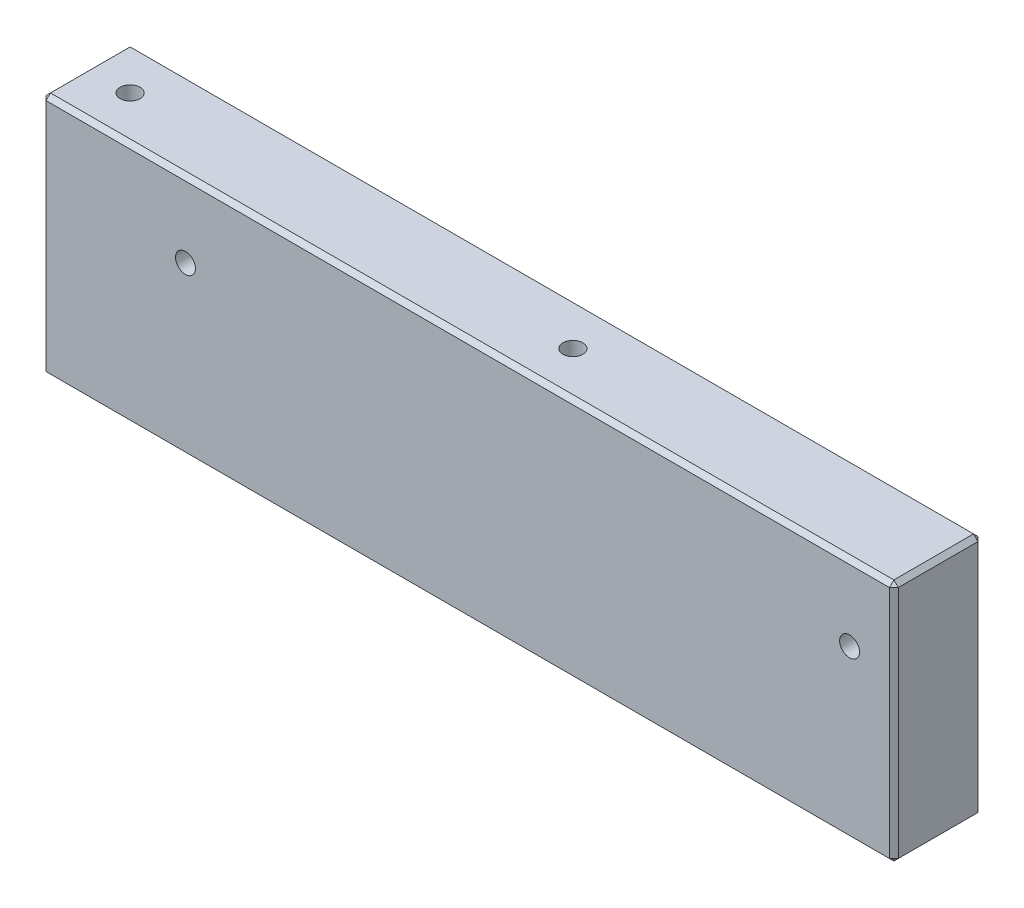
ISO-10303-21;
HEADER;
FILE_DESCRIPTION(('STEP AP214'),'2;1');
FILE_NAME('part.step','',(''),(''),'','','');
FILE_SCHEMA(('AUTOMOTIVE_DESIGN { 1 0 10303 214 1 1 1 1 }'));
ENDSEC;
DATA;
#1=APPLICATION_CONTEXT('core data for automotive mechanical design processes');
#2=APPLICATION_PROTOCOL_DEFINITION('international standard','automotive_design',2000,#1);
#3=PRODUCT_CONTEXT('',#1,'mechanical');
#4=PRODUCT('Part','Part','',(#3));
#5=PRODUCT_RELATED_PRODUCT_CATEGORY('part','',(#4));
#6=PRODUCT_DEFINITION_FORMATION('','',#4);
#7=PRODUCT_DEFINITION_CONTEXT('part definition',#1,'design');
#8=PRODUCT_DEFINITION('design','',#6,#7);
#9=PRODUCT_DEFINITION_SHAPE('','',#8);
#10=(LENGTH_UNIT() NAMED_UNIT(*) SI_UNIT(.MILLI.,.METRE.));
#11=(NAMED_UNIT(*) PLANE_ANGLE_UNIT() SI_UNIT($,.RADIAN.));
#12=(NAMED_UNIT(*) SI_UNIT($,.STERADIAN.) SOLID_ANGLE_UNIT());
#13=UNCERTAINTY_MEASURE_WITH_UNIT(LENGTH_MEASURE(1.E-05),#10,'distance_accuracy_value','');
#14=(GEOMETRIC_REPRESENTATION_CONTEXT(3) GLOBAL_UNCERTAINTY_ASSIGNED_CONTEXT((#13)) GLOBAL_UNIT_ASSIGNED_CONTEXT((#10,
#11,#12)) REPRESENTATION_CONTEXT('',''));
#15=CARTESIAN_POINT('',(0.,0.,0.));
#16=DIRECTION('',(0.,0.,1.));
#17=DIRECTION('',(1.,0.,0.));
#18=AXIS2_PLACEMENT_3D('',#15,#16,#17);
#19=CARTESIAN_POINT('',(0.,0.,20.));
#20=DIRECTION('',(-1.,0.,0.));
#21=DIRECTION('',(0.,-1.,0.));
#22=AXIS2_PLACEMENT_3D('',#19,#20,#21);
#23=PLANE('',#22);
#24=DIRECTION('',(0.,1.,0.));
#25=VECTOR('',#24,1.);
#26=CARTESIAN_POINT('',(0.,55.,19.));
#27=LINE('',#26,#25);
#28=CARTESIAN_POINT('',(0.,1.,19.));
#29=VERTEX_POINT('',#28);
#30=CARTESIAN_POINT('',(0.,54.,19.));
#31=VERTEX_POINT('',#30);
#32=EDGE_CURVE('E195',#29,#31,#27,.T.);
#33=ORIENTED_EDGE('',*,*,#32,.T.);
#34=DIRECTION('',(0.,0.,-1.));
#35=VECTOR('',#34,1.);
#36=CARTESIAN_POINT('',(0.,54.,20.));
#37=LINE('',#36,#35);
#38=CARTESIAN_POINT('',(0.,54.,1.));
#39=VERTEX_POINT('',#38);
#40=EDGE_CURVE('E199',#31,#39,#37,.T.);
#41=ORIENTED_EDGE('',*,*,#40,.T.);
#42=DIRECTION('',(0.,-1.,0.));
#43=VECTOR('',#42,1.);
#44=CARTESIAN_POINT('',(0.,0.,1.));
#45=LINE('',#44,#43);
#46=CARTESIAN_POINT('',(0.,1.,1.));
#47=VERTEX_POINT('',#46);
#48=EDGE_CURVE('E197',#39,#47,#45,.T.);
#49=ORIENTED_EDGE('',*,*,#48,.T.);
#50=DIRECTION('',(0.,0.,1.));
#51=VECTOR('',#50,1.);
#52=CARTESIAN_POINT('',(0.,1.,20.));
#53=LINE('',#52,#51);
#54=EDGE_CURVE('E193',#47,#29,#53,.T.);
#55=ORIENTED_EDGE('',*,*,#54,.T.);
#56=EDGE_LOOP('',(#33,#41,#49,#55));
#57=FACE_BOUND('',#56,.T.);
#58=ADVANCED_FACE('F39',(#57),#23,.T.);
#59=CARTESIAN_POINT('',(192.5,0.,20.));
#60=DIRECTION('',(0.,-1.,0.));
#61=DIRECTION('',(1.,0.,0.));
#62=AXIS2_PLACEMENT_3D('',#59,#60,#61);
#63=PLANE('',#62);
#64=DIRECTION('',(0.,0.,-1.));
#65=VECTOR('',#64,1.);
#66=CARTESIAN_POINT('',(1.,0.,20.));
#67=LINE('',#66,#65);
#68=CARTESIAN_POINT('',(1.,0.,19.));
#69=VERTEX_POINT('',#68);
#70=CARTESIAN_POINT('',(1.,0.,1.));
#71=VERTEX_POINT('',#70);
#72=EDGE_CURVE('E64',#69,#71,#67,.T.);
#73=ORIENTED_EDGE('',*,*,#72,.T.);
#74=DIRECTION('',(1.,0.,0.));
#75=VECTOR('',#74,1.);
#76=CARTESIAN_POINT('',(192.5,0.,1.));
#77=LINE('',#76,#75);
#78=CARTESIAN_POINT('',(191.5,0.,1.));
#79=VERTEX_POINT('',#78);
#80=EDGE_CURVE('E11',#71,#79,#77,.T.);
#81=ORIENTED_EDGE('',*,*,#80,.T.);
#82=DIRECTION('',(0.,0.,1.));
#83=VECTOR('',#82,1.);
#84=CARTESIAN_POINT('',(191.5,0.,20.));
#85=LINE('',#84,#83);
#86=CARTESIAN_POINT('',(191.5,0.,19.));
#87=VERTEX_POINT('',#86);
#88=EDGE_CURVE('E49',#79,#87,#85,.T.);
#89=ORIENTED_EDGE('',*,*,#88,.T.);
#90=DIRECTION('',(-1.,0.,0.));
#91=VECTOR('',#90,1.);
#92=CARTESIAN_POINT('',(0.,0.,19.));
#93=LINE('',#92,#91);
#94=EDGE_CURVE('E211',#87,#69,#93,.T.);
#95=ORIENTED_EDGE('',*,*,#94,.T.);
#96=EDGE_LOOP('',(#73,#81,#89,#95));
#97=FACE_BOUND('',#96,.T.);
#98=CARTESIAN_POINT('',(110.,0.,9.99999999999974));
#99=DIRECTION('',(0.,-1.,0.));
#100=DIRECTION('',(0.,0.,-1.));
#101=AXIS2_PLACEMENT_3D('',#98,#99,#100);
#102=CIRCLE('',#101,4.49999999999999);
#103=CARTESIAN_POINT('',(110.,0.,5.49999999999975));
#104=VERTEX_POINT('',#103);
#105=EDGE_CURVE('E298',#104,#104,#102,.T.);
#106=ORIENTED_EDGE('',*,*,#105,.F.);
#107=EDGE_LOOP('',(#106));
#108=FACE_BOUND('',#107,.T.);
#109=CARTESIAN_POINT('',(10.,0.,9.99999999999997));
#110=DIRECTION('',(0.,-1.,0.));
#111=DIRECTION('',(0.,0.,-1.));
#112=AXIS2_PLACEMENT_3D('',#109,#110,#111);
#113=CIRCLE('',#112,4.49999999999999);
#114=CARTESIAN_POINT('',(10.,0.,5.49999999999998));
#115=VERTEX_POINT('',#114);
#116=EDGE_CURVE('E310',#115,#115,#113,.T.);
#117=ORIENTED_EDGE('',*,*,#116,.F.);
#118=EDGE_LOOP('',(#117));
#119=FACE_BOUND('',#118,.T.);
#120=ADVANCED_FACE('F333',(#97,#108,#119),#63,.T.);
#121=CARTESIAN_POINT('',(192.5,55.,20.));
#122=DIRECTION('',(1.,0.,0.));
#123=DIRECTION('',(0.,0.,-1.));
#124=AXIS2_PLACEMENT_3D('',#121,#122,#123);
#125=PLANE('',#124);
#126=DIRECTION('',(0.,0.,-1.));
#127=VECTOR('',#126,1.);
#128=CARTESIAN_POINT('',(192.5,1.,20.));
#129=LINE('',#128,#127);
#130=CARTESIAN_POINT('',(192.5,1.,19.));
#131=VERTEX_POINT('',#130);
#132=CARTESIAN_POINT('',(192.5,1.,1.));
#133=VERTEX_POINT('',#132);
#134=EDGE_CURVE('E186',#131,#133,#129,.T.);
#135=ORIENTED_EDGE('',*,*,#134,.T.);
#136=DIRECTION('',(0.,1.,0.));
#137=VECTOR('',#136,1.);
#138=CARTESIAN_POINT('',(192.5,55.,1.));
#139=LINE('',#138,#137);
#140=CARTESIAN_POINT('',(192.5,54.,1.));
#141=VERTEX_POINT('',#140);
#142=EDGE_CURVE('E190',#133,#141,#139,.T.);
#143=ORIENTED_EDGE('',*,*,#142,.T.);
#144=DIRECTION('',(0.,0.,1.));
#145=VECTOR('',#144,1.);
#146=CARTESIAN_POINT('',(192.5,54.,20.));
#147=LINE('',#146,#145);
#148=CARTESIAN_POINT('',(192.5,54.,19.));
#149=VERTEX_POINT('',#148);
#150=EDGE_CURVE('E188',#141,#149,#147,.T.);
#151=ORIENTED_EDGE('',*,*,#150,.T.);
#152=DIRECTION('',(0.,-1.,0.));
#153=VECTOR('',#152,1.);
#154=CARTESIAN_POINT('',(192.5,0.,19.));
#155=LINE('',#154,#153);
#156=EDGE_CURVE('E184',#149,#131,#155,.T.);
#157=ORIENTED_EDGE('',*,*,#156,.T.);
#158=EDGE_LOOP('',(#135,#143,#151,#157));
#159=FACE_BOUND('',#158,.T.);
#160=ADVANCED_FACE('F335',(#159),#125,.T.);
#161=CARTESIAN_POINT('',(0.,55.,20.));
#162=DIRECTION('',(0.,1.,0.));
#163=DIRECTION('',(0.,0.,1.));
#164=AXIS2_PLACEMENT_3D('',#161,#162,#163);
#165=PLANE('',#164);
#166=DIRECTION('',(0.,0.,-1.));
#167=VECTOR('',#166,1.);
#168=CARTESIAN_POINT('',(191.5,55.,20.));
#169=LINE('',#168,#167);
#170=CARTESIAN_POINT('',(191.5,55.,19.));
#171=VERTEX_POINT('',#170);
#172=CARTESIAN_POINT('',(191.5,55.,1.));
#173=VERTEX_POINT('',#172);
#174=EDGE_CURVE('E177',#171,#173,#169,.T.);
#175=ORIENTED_EDGE('',*,*,#174,.T.);
#176=DIRECTION('',(-1.,0.,0.));
#177=VECTOR('',#176,1.);
#178=CARTESIAN_POINT('',(0.,55.,1.));
#179=LINE('',#178,#177);
#180=CARTESIAN_POINT('',(1.,55.,1.));
#181=VERTEX_POINT('',#180);
#182=EDGE_CURVE('E181',#173,#181,#179,.T.);
#183=ORIENTED_EDGE('',*,*,#182,.T.);
#184=DIRECTION('',(0.,0.,1.));
#185=VECTOR('',#184,1.);
#186=CARTESIAN_POINT('',(1.,55.,20.));
#187=LINE('',#186,#185);
#188=CARTESIAN_POINT('',(1.,55.,19.));
#189=VERTEX_POINT('',#188);
#190=EDGE_CURVE('E179',#181,#189,#187,.T.);
#191=ORIENTED_EDGE('',*,*,#190,.T.);
#192=DIRECTION('',(1.,0.,0.));
#193=VECTOR('',#192,1.);
#194=CARTESIAN_POINT('',(192.5,55.,19.));
#195=LINE('',#194,#193);
#196=EDGE_CURVE('E175',#189,#171,#195,.T.);
#197=ORIENTED_EDGE('',*,*,#196,.T.);
#198=EDGE_LOOP('',(#175,#183,#191,#197));
#199=FACE_BOUND('',#198,.T.);
#200=CARTESIAN_POINT('',(110.,55.,9.99999999999974));
#201=DIRECTION('',(0.,-1.,0.));
#202=DIRECTION('',(0.,0.,-1.));
#203=AXIS2_PLACEMENT_3D('',#200,#201,#202);
#204=CIRCLE('',#203,2.24999999999999);
#205=CARTESIAN_POINT('',(110.,55.,7.74999999999975));
#206=VERTEX_POINT('',#205);
#207=EDGE_CURVE('E307',#206,#206,#204,.T.);
#208=ORIENTED_EDGE('',*,*,#207,.T.);
#209=EDGE_LOOP('',(#208));
#210=FACE_BOUND('',#209,.T.);
#211=CARTESIAN_POINT('',(10.,55.,9.99999999999997));
#212=DIRECTION('',(0.,-1.,0.));
#213=DIRECTION('',(0.,0.,-1.));
#214=AXIS2_PLACEMENT_3D('',#211,#212,#213);
#215=CIRCLE('',#214,2.24999999999999);
#216=CARTESIAN_POINT('',(10.,55.,7.74999999999998));
#217=VERTEX_POINT('',#216);
#218=EDGE_CURVE('E165',#217,#217,#215,.T.);
#219=ORIENTED_EDGE('',*,*,#218,.T.);
#220=EDGE_LOOP('',(#219));
#221=FACE_BOUND('',#220,.T.);
#222=ADVANCED_FACE('F341',(#199,#210,#221),#165,.T.);
#223=CARTESIAN_POINT('',(0.,0.,20.));
#224=DIRECTION('',(0.,0.,-1.));
#225=DIRECTION('',(-1.,0.,0.));
#226=AXIS2_PLACEMENT_3D('',#223,#224,#225);
#227=PLANE('',#226);
#228=DIRECTION('',(0.,1.,0.));
#229=VECTOR('',#228,1.);
#230=CARTESIAN_POINT('',(191.5,55.,20.));
#231=LINE('',#230,#229);
#232=CARTESIAN_POINT('',(191.5,1.,20.));
#233=VERTEX_POINT('',#232);
#234=CARTESIAN_POINT('',(191.5,54.,20.));
#235=VERTEX_POINT('',#234);
#236=EDGE_CURVE('E204',#233,#235,#231,.T.);
#237=ORIENTED_EDGE('',*,*,#236,.T.);
#238=DIRECTION('',(-1.,0.,0.));
#239=VECTOR('',#238,1.);
#240=CARTESIAN_POINT('',(0.,54.,20.));
#241=LINE('',#240,#239);
#242=CARTESIAN_POINT('',(1.,54.,20.));
#243=VERTEX_POINT('',#242);
#244=EDGE_CURVE('E208',#235,#243,#241,.T.);
#245=ORIENTED_EDGE('',*,*,#244,.T.);
#246=DIRECTION('',(0.,-1.,0.));
#247=VECTOR('',#246,1.);
#248=CARTESIAN_POINT('',(1.,0.,20.));
#249=LINE('',#248,#247);
#250=CARTESIAN_POINT('',(1.,1.,20.));
#251=VERTEX_POINT('',#250);
#252=EDGE_CURVE('E206',#243,#251,#249,.T.);
#253=ORIENTED_EDGE('',*,*,#252,.T.);
#254=DIRECTION('',(1.,0.,0.));
#255=VECTOR('',#254,1.);
#256=CARTESIAN_POINT('',(192.5,1.,20.));
#257=LINE('',#256,#255);
#258=EDGE_CURVE('E202',#251,#233,#257,.T.);
#259=ORIENTED_EDGE('',*,*,#258,.T.);
#260=EDGE_LOOP('',(#237,#245,#253,#259));
#261=FACE_BOUND('',#260,.T.);
#262=CARTESIAN_POINT('',(182.5,38.,20.));
#263=DIRECTION('',(0.,0.,-1.));
#264=DIRECTION('',(-1.,0.,0.));
#265=AXIS2_PLACEMENT_3D('',#262,#263,#264);
#266=CIRCLE('',#265,2.25);
#267=CARTESIAN_POINT('',(180.25,38.,20.));
#268=VERTEX_POINT('',#267);
#269=EDGE_CURVE('E283',#268,#268,#266,.T.);
#270=ORIENTED_EDGE('',*,*,#269,.T.);
#271=EDGE_LOOP('',(#270));
#272=FACE_BOUND('',#271,.T.);
#273=CARTESIAN_POINT('',(32.5,38.,20.));
#274=DIRECTION('',(0.,0.,-1.));
#275=DIRECTION('',(-1.,0.,0.));
#276=AXIS2_PLACEMENT_3D('',#273,#274,#275);
#277=CIRCLE('',#276,2.25000000000001);
#278=CARTESIAN_POINT('',(30.25,38.,20.));
#279=VERTEX_POINT('',#278);
#280=EDGE_CURVE('E295',#279,#279,#277,.T.);
#281=ORIENTED_EDGE('',*,*,#280,.T.);
#282=EDGE_LOOP('',(#281));
#283=FACE_BOUND('',#282,.T.);
#284=ADVANCED_FACE('F351',(#261,#272,#283),#227,.F.);
#285=CARTESIAN_POINT('',(0.,0.,0.));
#286=DIRECTION('',(0.,0.,-1.));
#287=DIRECTION('',(-1.,0.,0.));
#288=AXIS2_PLACEMENT_3D('',#285,#286,#287);
#289=PLANE('',#288);
#290=DIRECTION('',(0.,1.,0.));
#291=VECTOR('',#290,1.);
#292=CARTESIAN_POINT('',(1.,0.,0.));
#293=LINE('',#292,#291);
#294=CARTESIAN_POINT('',(1.,1.,0.));
#295=VERTEX_POINT('',#294);
#296=CARTESIAN_POINT('',(1.,54.,0.));
#297=VERTEX_POINT('',#296);
#298=EDGE_CURVE('E138',#295,#297,#293,.T.);
#299=ORIENTED_EDGE('',*,*,#298,.T.);
#300=DIRECTION('',(1.,0.,0.));
#301=VECTOR('',#300,1.);
#302=CARTESIAN_POINT('',(0.,54.,0.));
#303=LINE('',#302,#301);
#304=CARTESIAN_POINT('',(191.5,54.,0.));
#305=VERTEX_POINT('',#304);
#306=EDGE_CURVE('E173',#297,#305,#303,.T.);
#307=ORIENTED_EDGE('',*,*,#306,.T.);
#308=DIRECTION('',(0.,-1.,0.));
#309=VECTOR('',#308,1.);
#310=CARTESIAN_POINT('',(191.5,0.,0.));
#311=LINE('',#310,#309);
#312=CARTESIAN_POINT('',(191.5,1.,0.));
#313=VERTEX_POINT('',#312);
#314=EDGE_CURVE('E141',#305,#313,#311,.T.);
#315=ORIENTED_EDGE('',*,*,#314,.T.);
#316=DIRECTION('',(-1.,0.,0.));
#317=VECTOR('',#316,1.);
#318=CARTESIAN_POINT('',(0.,1.,0.));
#319=LINE('',#318,#317);
#320=EDGE_CURVE('E132',#313,#295,#319,.T.);
#321=ORIENTED_EDGE('',*,*,#320,.T.);
#322=EDGE_LOOP('',(#299,#307,#315,#321));
#323=FACE_BOUND('',#322,.T.);
#324=CARTESIAN_POINT('',(182.5,38.,0.));
#325=DIRECTION('',(0.,0.,-1.));
#326=DIRECTION('',(-1.,0.,0.));
#327=AXIS2_PLACEMENT_3D('',#324,#325,#326);
#328=CIRCLE('',#327,4.5);
#329=CARTESIAN_POINT('',(178.,38.,0.));
#330=VERTEX_POINT('',#329);
#331=EDGE_CURVE('E267',#330,#330,#328,.T.);
#332=ORIENTED_EDGE('',*,*,#331,.F.);
#333=EDGE_LOOP('',(#332));
#334=FACE_BOUND('',#333,.T.);
#335=CARTESIAN_POINT('',(32.5,38.,0.));
#336=DIRECTION('',(0.,0.,-1.));
#337=DIRECTION('',(-1.,0.,0.));
#338=AXIS2_PLACEMENT_3D('',#335,#336,#337);
#339=CIRCLE('',#338,4.5);
#340=CARTESIAN_POINT('',(28.,38.,0.));
#341=VERTEX_POINT('',#340);
#342=EDGE_CURVE('E286',#341,#341,#339,.T.);
#343=ORIENTED_EDGE('',*,*,#342,.F.);
#344=EDGE_LOOP('',(#343));
#345=FACE_BOUND('',#344,.T.);
#346=ADVANCED_FACE('F134',(#323,#334,#345),#289,.T.);
#347=CARTESIAN_POINT('',(10.,0.,9.99999999999997));
#348=DIRECTION('',(0.,-1.,0.));
#349=DIRECTION('',(0.,0.,-1.));
#350=AXIS2_PLACEMENT_3D('',#347,#348,#349);
#351=CYLINDRICAL_SURFACE('',#350,2.25);
#352=ORIENTED_EDGE('',*,*,#218,.F.);
#353=EDGE_LOOP('',(#352));
#354=FACE_BOUND('',#353,.T.);
#355=CARTESIAN_POINT('',(10.,50.,9.99999999999997));
#356=DIRECTION('',(0.,-1.,0.));
#357=DIRECTION('',(0.,0.,-1.));
#358=AXIS2_PLACEMENT_3D('',#355,#356,#357);
#359=CIRCLE('',#358,2.25);
#360=CARTESIAN_POINT('',(10.,50.,7.74999999999997));
#361=VERTEX_POINT('',#360);
#362=EDGE_CURVE('E168',#361,#361,#359,.T.);
#363=ORIENTED_EDGE('',*,*,#362,.T.);
#364=EDGE_LOOP('',(#363));
#365=FACE_BOUND('',#364,.T.);
#366=ADVANCED_FACE('F318',(#354,#365),#351,.F.);
#367=CARTESIAN_POINT('',(12.25,50.,9.99999999999997));
#368=DIRECTION('',(0.,1.,0.));
#369=DIRECTION('',(0.,0.,1.));
#370=AXIS2_PLACEMENT_3D('',#367,#368,#369);
#371=PLANE('',#370);
#372=ORIENTED_EDGE('',*,*,#362,.F.);
#373=EDGE_LOOP('',(#372));
#374=FACE_BOUND('',#373,.T.);
#375=CARTESIAN_POINT('',(10.,50.,9.99999999999997));
#376=DIRECTION('',(0.,-1.,0.));
#377=DIRECTION('',(0.,0.,-1.));
#378=AXIS2_PLACEMENT_3D('',#375,#376,#377);
#379=CIRCLE('',#378,4.49999999999998);
#380=CARTESIAN_POINT('',(10.,50.,5.49999999999999));
#381=VERTEX_POINT('',#380);
#382=EDGE_CURVE('E313',#381,#381,#379,.T.);
#383=ORIENTED_EDGE('',*,*,#382,.T.);
#384=EDGE_LOOP('',(#383));
#385=FACE_BOUND('',#384,.T.);
#386=ADVANCED_FACE('F320',(#374,#385),#371,.F.);
#387=CARTESIAN_POINT('',(10.,0.,9.99999999999997));
#388=DIRECTION('',(0.,-1.,0.));
#389=DIRECTION('',(0.,0.,-1.));
#390=AXIS2_PLACEMENT_3D('',#387,#388,#389);
#391=CYLINDRICAL_SURFACE('',#390,4.49999999999998);
#392=ORIENTED_EDGE('',*,*,#382,.F.);
#393=EDGE_LOOP('',(#392));
#394=FACE_BOUND('',#393,.T.);
#395=ORIENTED_EDGE('',*,*,#116,.T.);
#396=EDGE_LOOP('',(#395));
#397=FACE_BOUND('',#396,.T.);
#398=ADVANCED_FACE('F323',(#394,#397),#391,.F.);
#399=CARTESIAN_POINT('',(110.,0.,9.99999999999974));
#400=DIRECTION('',(0.,-1.,0.));
#401=DIRECTION('',(0.,0.,-1.));
#402=AXIS2_PLACEMENT_3D('',#399,#400,#401);
#403=CYLINDRICAL_SURFACE('',#402,2.25);
#404=ORIENTED_EDGE('',*,*,#207,.F.);
#405=EDGE_LOOP('',(#404));
#406=FACE_BOUND('',#405,.T.);
#407=CARTESIAN_POINT('',(110.,50.,9.99999999999974));
#408=DIRECTION('',(0.,-1.,0.));
#409=DIRECTION('',(0.,0.,-1.));
#410=AXIS2_PLACEMENT_3D('',#407,#408,#409);
#411=CIRCLE('',#410,2.25);
#412=CARTESIAN_POINT('',(110.,50.,7.74999999999974));
#413=VERTEX_POINT('',#412);
#414=EDGE_CURVE('E304',#413,#413,#411,.T.);
#415=ORIENTED_EDGE('',*,*,#414,.T.);
#416=EDGE_LOOP('',(#415));
#417=FACE_BOUND('',#416,.T.);
#418=ADVANCED_FACE('F329',(#406,#417),#403,.F.);
#419=CARTESIAN_POINT('',(112.25,50.,9.99999999999974));
#420=DIRECTION('',(0.,1.,0.));
#421=DIRECTION('',(0.,0.,1.));
#422=AXIS2_PLACEMENT_3D('',#419,#420,#421);
#423=PLANE('',#422);
#424=ORIENTED_EDGE('',*,*,#414,.F.);
#425=EDGE_LOOP('',(#424));
#426=FACE_BOUND('',#425,.T.);
#427=CARTESIAN_POINT('',(110.,50.,9.99999999999974));
#428=DIRECTION('',(0.,-1.,0.));
#429=DIRECTION('',(0.,0.,-1.));
#430=AXIS2_PLACEMENT_3D('',#427,#428,#429);
#431=CIRCLE('',#430,4.49999999999999);
#432=CARTESIAN_POINT('',(110.,50.,5.49999999999975));
#433=VERTEX_POINT('',#432);
#434=EDGE_CURVE('E301',#433,#433,#431,.T.);
#435=ORIENTED_EDGE('',*,*,#434,.T.);
#436=EDGE_LOOP('',(#435));
#437=FACE_BOUND('',#436,.T.);
#438=ADVANCED_FACE('F706',(#426,#437),#423,.F.);
#439=CARTESIAN_POINT('',(110.,0.,9.99999999999974));
#440=DIRECTION('',(0.,-1.,0.));
#441=DIRECTION('',(0.,0.,-1.));
#442=AXIS2_PLACEMENT_3D('',#439,#440,#441);
#443=CYLINDRICAL_SURFACE('',#442,4.49999999999999);
#444=ORIENTED_EDGE('',*,*,#434,.F.);
#445=EDGE_LOOP('',(#444));
#446=FACE_BOUND('',#445,.T.);
#447=ORIENTED_EDGE('',*,*,#105,.T.);
#448=EDGE_LOOP('',(#447));
#449=FACE_BOUND('',#448,.T.);
#450=ADVANCED_FACE('F698',(#446,#449),#443,.F.);
#451=CARTESIAN_POINT('',(32.5,38.,0.));
#452=DIRECTION('',(0.,0.,-1.));
#453=DIRECTION('',(-1.,0.,0.));
#454=AXIS2_PLACEMENT_3D('',#451,#452,#453);
#455=CYLINDRICAL_SURFACE('',#454,2.25000000000001);
#456=ORIENTED_EDGE('',*,*,#280,.F.);
#457=EDGE_LOOP('',(#456));
#458=FACE_BOUND('',#457,.T.);
#459=CARTESIAN_POINT('',(32.5,38.,5.));
#460=DIRECTION('',(0.,0.,-1.));
#461=DIRECTION('',(-1.,0.,0.));
#462=AXIS2_PLACEMENT_3D('',#459,#460,#461);
#463=CIRCLE('',#462,2.25000000000002);
#464=CARTESIAN_POINT('',(30.25,38.,5.));
#465=VERTEX_POINT('',#464);
#466=EDGE_CURVE('E292',#465,#465,#463,.T.);
#467=ORIENTED_EDGE('',*,*,#466,.T.);
#468=EDGE_LOOP('',(#467));
#469=FACE_BOUND('',#468,.T.);
#470=ADVANCED_FACE('F690',(#458,#469),#455,.F.);
#471=CARTESIAN_POINT('',(34.75,38.,5.));
#472=DIRECTION('',(0.,0.,1.));
#473=DIRECTION('',(1.,0.,0.));
#474=AXIS2_PLACEMENT_3D('',#471,#472,#473);
#475=PLANE('',#474);
#476=ORIENTED_EDGE('',*,*,#466,.F.);
#477=EDGE_LOOP('',(#476));
#478=FACE_BOUND('',#477,.T.);
#479=CARTESIAN_POINT('',(32.5,38.,5.));
#480=DIRECTION('',(0.,0.,-1.));
#481=DIRECTION('',(-1.,0.,0.));
#482=AXIS2_PLACEMENT_3D('',#479,#480,#481);
#483=CIRCLE('',#482,4.5);
#484=CARTESIAN_POINT('',(28.,38.,5.));
#485=VERTEX_POINT('',#484);
#486=EDGE_CURVE('E289',#485,#485,#483,.T.);
#487=ORIENTED_EDGE('',*,*,#486,.T.);
#488=EDGE_LOOP('',(#487));
#489=FACE_BOUND('',#488,.T.);
#490=ADVANCED_FACE('F682',(#478,#489),#475,.F.);
#491=CARTESIAN_POINT('',(32.5,38.,0.));
#492=DIRECTION('',(0.,0.,-1.));
#493=DIRECTION('',(-1.,0.,0.));
#494=AXIS2_PLACEMENT_3D('',#491,#492,#493);
#495=CYLINDRICAL_SURFACE('',#494,4.5);
#496=ORIENTED_EDGE('',*,*,#486,.F.);
#497=EDGE_LOOP('',(#496));
#498=FACE_BOUND('',#497,.T.);
#499=ORIENTED_EDGE('',*,*,#342,.T.);
#500=EDGE_LOOP('',(#499));
#501=FACE_BOUND('',#500,.T.);
#502=ADVANCED_FACE('F674',(#498,#501),#495,.F.);
#503=CARTESIAN_POINT('',(182.5,38.,0.));
#504=DIRECTION('',(0.,0.,-1.));
#505=DIRECTION('',(-1.,0.,0.));
#506=AXIS2_PLACEMENT_3D('',#503,#504,#505);
#507=CYLINDRICAL_SURFACE('',#506,2.25);
#508=ORIENTED_EDGE('',*,*,#269,.F.);
#509=EDGE_LOOP('',(#508));
#510=FACE_BOUND('',#509,.T.);
#511=CARTESIAN_POINT('',(182.5,38.,5.));
#512=DIRECTION('',(0.,0.,-1.));
#513=DIRECTION('',(-1.,0.,0.));
#514=AXIS2_PLACEMENT_3D('',#511,#512,#513);
#515=CIRCLE('',#514,2.25);
#516=CARTESIAN_POINT('',(180.25,38.,5.));
#517=VERTEX_POINT('',#516);
#518=EDGE_CURVE('E278',#517,#517,#515,.T.);
#519=ORIENTED_EDGE('',*,*,#518,.T.);
#520=EDGE_LOOP('',(#519));
#521=FACE_BOUND('',#520,.T.);
#522=ADVANCED_FACE('F666',(#510,#521),#507,.F.);
#523=CARTESIAN_POINT('',(184.75,38.,5.));
#524=DIRECTION('',(0.,0.,1.));
#525=DIRECTION('',(1.,0.,0.));
#526=AXIS2_PLACEMENT_3D('',#523,#524,#525);
#527=PLANE('',#526);
#528=ORIENTED_EDGE('',*,*,#518,.F.);
#529=EDGE_LOOP('',(#528));
#530=FACE_BOUND('',#529,.T.);
#531=CARTESIAN_POINT('',(182.5,38.,5.));
#532=DIRECTION('',(0.,0.,-1.));
#533=DIRECTION('',(-1.,0.,0.));
#534=AXIS2_PLACEMENT_3D('',#531,#532,#533);
#535=CIRCLE('',#534,4.5);
#536=CARTESIAN_POINT('',(178.,38.,5.));
#537=VERTEX_POINT('',#536);
#538=EDGE_CURVE('E273',#537,#537,#535,.T.);
#539=ORIENTED_EDGE('',*,*,#538,.T.);
#540=EDGE_LOOP('',(#539));
#541=FACE_BOUND('',#540,.T.);
#542=ADVANCED_FACE('F658',(#530,#541),#527,.F.);
#543=CARTESIAN_POINT('',(182.5,38.,0.));
#544=DIRECTION('',(0.,0.,-1.));
#545=DIRECTION('',(-1.,0.,0.));
#546=AXIS2_PLACEMENT_3D('',#543,#544,#545);
#547=CYLINDRICAL_SURFACE('',#546,4.5);
#548=ORIENTED_EDGE('',*,*,#538,.F.);
#549=EDGE_LOOP('',(#548));
#550=FACE_BOUND('',#549,.T.);
#551=ORIENTED_EDGE('',*,*,#331,.T.);
#552=EDGE_LOOP('',(#551));
#553=FACE_BOUND('',#552,.T.);
#554=ADVANCED_FACE('F479',(#550,#553),#547,.F.);
#555=CARTESIAN_POINT('',(192.5,0.,19.));
#556=DIRECTION('',(0.,-0.707106781186547,0.707106781186547));
#557=DIRECTION('',(1.,0.,0.));
#558=AXIS2_PLACEMENT_3D('',#555,#556,#557);
#559=PLANE('',#558);
#560=DIRECTION('',(0.,0.707106781186547,0.707106781186547));
#561=VECTOR('',#560,1.);
#562=CARTESIAN_POINT('',(1.,1.,20.));
#563=LINE('',#562,#561);
#564=EDGE_CURVE('E44',#69,#251,#563,.T.);
#565=ORIENTED_EDGE('',*,*,#564,.F.);
#566=ORIENTED_EDGE('',*,*,#94,.F.);
#567=DIRECTION('',(0.,-0.707106781186547,-0.707106781186547));
#568=VECTOR('',#567,1.);
#569=CARTESIAN_POINT('',(191.5,0.,19.));
#570=LINE('',#569,#568);
#571=EDGE_CURVE('E260',#233,#87,#570,.T.);
#572=ORIENTED_EDGE('',*,*,#571,.F.);
#573=ORIENTED_EDGE('',*,*,#258,.F.);
#574=EDGE_LOOP('',(#565,#566,#572,#573));
#575=FACE_BOUND('',#574,.T.);
#576=ADVANCED_FACE('F42',(#575),#559,.T.);
#577=CARTESIAN_POINT('',(1.,1.,20.));
#578=DIRECTION('',(-0.577350269189626,-0.577350269189626,0.577350269189626));
#579=DIRECTION('',(0.707106781186547,0.,0.707106781186547));
#580=AXIS2_PLACEMENT_3D('',#577,#578,#579);
#581=PLANE('',#580);
#582=DIRECTION('',(-0.707106781186547,0.707106781186547,0.));
#583=VECTOR('',#582,1.);
#584=CARTESIAN_POINT('',(0.5,0.5,19.));
#585=LINE('',#584,#583);
#586=EDGE_CURVE('E255',#69,#29,#585,.T.);
#587=ORIENTED_EDGE('',*,*,#586,.F.);
#588=ORIENTED_EDGE('',*,*,#564,.T.);
#589=DIRECTION('',(-0.707106781186547,0.,-0.707106781186547));
#590=VECTOR('',#589,1.);
#591=CARTESIAN_POINT('',(1.,1.,20.));
#592=LINE('',#591,#590);
#593=EDGE_CURVE('E258',#29,#251,#592,.F.);
#594=ORIENTED_EDGE('',*,*,#593,.F.);
#595=EDGE_LOOP('',(#587,#588,#594));
#596=FACE_BOUND('',#595,.T.);
#597=ADVANCED_FACE('F472',(#596),#581,.T.);
#598=CARTESIAN_POINT('',(191.5,0.,19.));
#599=DIRECTION('',(0.577350269189626,-0.577350269189626,0.577350269189626));
#600=DIRECTION('',(0.707106781186547,0.,-0.707106781186547));
#601=AXIS2_PLACEMENT_3D('',#598,#599,#600);
#602=PLANE('',#601);
#603=DIRECTION('',(-0.707106781186547,0.,0.707106781186547));
#604=VECTOR('',#603,1.);
#605=CARTESIAN_POINT('',(192.,1.,19.5));
#606=LINE('',#605,#604);
#607=EDGE_CURVE('E249',#233,#131,#606,.F.);
#608=ORIENTED_EDGE('',*,*,#607,.F.);
#609=ORIENTED_EDGE('',*,*,#571,.T.);
#610=DIRECTION('',(-0.707106781186547,-0.707106781186547,0.));
#611=VECTOR('',#610,1.);
#612=CARTESIAN_POINT('',(191.5,0.,19.));
#613=LINE('',#612,#611);
#614=EDGE_CURVE('E252',#131,#87,#613,.T.);
#615=ORIENTED_EDGE('',*,*,#614,.F.);
#616=EDGE_LOOP('',(#608,#609,#615));
#617=FACE_BOUND('',#616,.T.);
#618=ADVANCED_FACE('F466',(#617),#602,.T.);
#619=CARTESIAN_POINT('',(0.,0.,19.));
#620=DIRECTION('',(-0.707106781186547,0.,0.707106781186547));
#621=DIRECTION('',(0.,-1.,0.));
#622=AXIS2_PLACEMENT_3D('',#619,#620,#621);
#623=PLANE('',#622);
#624=ORIENTED_EDGE('',*,*,#593,.T.);
#625=ORIENTED_EDGE('',*,*,#252,.F.);
#626=DIRECTION('',(0.707106781186547,0.,0.707106781186547));
#627=VECTOR('',#626,1.);
#628=CARTESIAN_POINT('',(0.5,54.,19.5));
#629=LINE('',#628,#627);
#630=EDGE_CURVE('E244',#31,#243,#629,.T.);
#631=ORIENTED_EDGE('',*,*,#630,.F.);
#632=ORIENTED_EDGE('',*,*,#32,.F.);
#633=EDGE_LOOP('',(#624,#625,#631,#632));
#634=FACE_BOUND('',#633,.T.);
#635=ADVANCED_FACE('F459',(#634),#623,.T.);
#636=CARTESIAN_POINT('',(1.,0.,20.));
#637=DIRECTION('',(0.707106781186547,0.707106781186547,0.));
#638=DIRECTION('',(0.,0.,-1.));
#639=AXIS2_PLACEMENT_3D('',#636,#637,#638);
#640=PLANE('',#639);
#641=ORIENTED_EDGE('',*,*,#586,.T.);
#642=ORIENTED_EDGE('',*,*,#54,.F.);
#643=DIRECTION('',(0.707106781186547,-0.707106781186547,0.));
#644=VECTOR('',#643,1.);
#645=CARTESIAN_POINT('',(0.5,0.5,1.));
#646=LINE('',#645,#644);
#647=EDGE_CURVE('E151',#71,#47,#646,.F.);
#648=ORIENTED_EDGE('',*,*,#647,.F.);
#649=ORIENTED_EDGE('',*,*,#72,.F.);
#650=EDGE_LOOP('',(#641,#642,#648,#649));
#651=FACE_BOUND('',#650,.T.);
#652=ADVANCED_FACE('F453',(#651),#640,.F.);
#653=CARTESIAN_POINT('',(0.,1.,0.));
#654=DIRECTION('',(0.,0.707106781186547,0.707106781186547));
#655=DIRECTION('',(-1.,0.,0.));
#656=AXIS2_PLACEMENT_3D('',#653,#654,#655);
#657=PLANE('',#656);
#658=DIRECTION('',(0.,-0.707106781186547,0.707106781186547));
#659=VECTOR('',#658,1.);
#660=CARTESIAN_POINT('',(191.5,1.,0.));
#661=LINE('',#660,#659);
#662=EDGE_CURVE('E152',#79,#313,#661,.F.);
#663=ORIENTED_EDGE('',*,*,#662,.F.);
#664=ORIENTED_EDGE('',*,*,#80,.F.);
#665=DIRECTION('',(0.,0.707106781186547,-0.707106781186547));
#666=VECTOR('',#665,1.);
#667=CARTESIAN_POINT('',(1.,1.,0.));
#668=LINE('',#667,#666);
#669=EDGE_CURVE('E145',#295,#71,#668,.F.);
#670=ORIENTED_EDGE('',*,*,#669,.F.);
#671=ORIENTED_EDGE('',*,*,#320,.F.);
#672=EDGE_LOOP('',(#663,#664,#670,#671));
#673=FACE_BOUND('',#672,.T.);
#674=ADVANCED_FACE('F147',(#673),#657,.F.);
#675=CARTESIAN_POINT('',(192.5,1.,20.));
#676=DIRECTION('',(-0.707106781186547,0.707106781186547,0.));
#677=DIRECTION('',(0.,0.,-1.));
#678=AXIS2_PLACEMENT_3D('',#675,#676,#677);
#679=PLANE('',#678);
#680=ORIENTED_EDGE('',*,*,#614,.T.);
#681=ORIENTED_EDGE('',*,*,#88,.F.);
#682=DIRECTION('',(0.707106781186547,0.707106781186547,0.));
#683=VECTOR('',#682,1.);
#684=CARTESIAN_POINT('',(192.,0.5,1.));
#685=LINE('',#684,#683);
#686=EDGE_CURVE('E57',#133,#79,#685,.F.);
#687=ORIENTED_EDGE('',*,*,#686,.F.);
#688=ORIENTED_EDGE('',*,*,#134,.F.);
#689=EDGE_LOOP('',(#680,#681,#687,#688));
#690=FACE_BOUND('',#689,.T.);
#691=ADVANCED_FACE('F440',(#690),#679,.F.);
#692=CARTESIAN_POINT('',(192.5,55.,19.));
#693=DIRECTION('',(0.707106781186547,0.,0.707106781186547));
#694=DIRECTION('',(0.,1.,0.));
#695=AXIS2_PLACEMENT_3D('',#692,#693,#694);
#696=PLANE('',#695);
#697=ORIENTED_EDGE('',*,*,#607,.T.);
#698=ORIENTED_EDGE('',*,*,#156,.F.);
#699=DIRECTION('',(0.707106781186547,0.,-0.707106781186547));
#700=VECTOR('',#699,1.);
#701=CARTESIAN_POINT('',(192.5,54.,19.));
#702=LINE('',#701,#700);
#703=EDGE_CURVE('E238',#235,#149,#702,.T.);
#704=ORIENTED_EDGE('',*,*,#703,.F.);
#705=ORIENTED_EDGE('',*,*,#236,.F.);
#706=EDGE_LOOP('',(#697,#698,#704,#705));
#707=FACE_BOUND('',#706,.T.);
#708=ADVANCED_FACE('F433',(#707),#696,.T.);
#709=CARTESIAN_POINT('',(0.,55.,19.));
#710=DIRECTION('',(0.,0.707106781186547,0.707106781186547));
#711=DIRECTION('',(-1.,0.,0.));
#712=AXIS2_PLACEMENT_3D('',#709,#710,#711);
#713=PLANE('',#712);
#714=DIRECTION('',(0.,0.707106781186547,-0.707106781186547));
#715=VECTOR('',#714,1.);
#716=CARTESIAN_POINT('',(1.,55.,19.));
#717=LINE('',#716,#715);
#718=EDGE_CURVE('E246',#243,#189,#717,.T.);
#719=ORIENTED_EDGE('',*,*,#718,.F.);
#720=ORIENTED_EDGE('',*,*,#244,.F.);
#721=DIRECTION('',(0.,-0.707106781186547,0.707106781186547));
#722=VECTOR('',#721,1.);
#723=CARTESIAN_POINT('',(191.5,54.5,19.5));
#724=LINE('',#723,#722);
#725=EDGE_CURVE('E235',#171,#235,#724,.T.);
#726=ORIENTED_EDGE('',*,*,#725,.F.);
#727=ORIENTED_EDGE('',*,*,#196,.F.);
#728=EDGE_LOOP('',(#719,#720,#726,#727));
#729=FACE_BOUND('',#728,.T.);
#730=ADVANCED_FACE('F426',(#729),#713,.T.);
#731=CARTESIAN_POINT('',(1.,55.,19.));
#732=DIRECTION('',(-0.577350269189626,0.577350269189626,0.577350269189626));
#733=DIRECTION('',(0.707106781186547,0.,0.707106781186547));
#734=AXIS2_PLACEMENT_3D('',#731,#732,#733);
#735=PLANE('',#734);
#736=ORIENTED_EDGE('',*,*,#630,.T.);
#737=ORIENTED_EDGE('',*,*,#718,.T.);
#738=DIRECTION('',(0.707106781186547,0.707106781186547,0.));
#739=VECTOR('',#738,1.);
#740=CARTESIAN_POINT('',(1.,55.,19.));
#741=LINE('',#740,#739);
#742=EDGE_CURVE('E159',#31,#189,#741,.T.);
#743=ORIENTED_EDGE('',*,*,#742,.F.);
#744=EDGE_LOOP('',(#736,#737,#743));
#745=FACE_BOUND('',#744,.T.);
#746=ADVANCED_FACE('F420',(#745),#735,.T.);
#747=CARTESIAN_POINT('',(1.,1.,0.));
#748=DIRECTION('',(-0.577350269189626,-0.577350269189626,-0.577350269189626));
#749=DIRECTION('',(-0.707106781186547,0.,0.707106781186547));
#750=AXIS2_PLACEMENT_3D('',#747,#748,#749);
#751=PLANE('',#750);
#752=ORIENTED_EDGE('',*,*,#669,.T.);
#753=ORIENTED_EDGE('',*,*,#647,.T.);
#754=DIRECTION('',(-0.707106781186547,0.,0.707106781186547));
#755=VECTOR('',#754,1.);
#756=CARTESIAN_POINT('',(1.,1.,0.));
#757=LINE('',#756,#755);
#758=EDGE_CURVE('E155',#295,#47,#757,.T.);
#759=ORIENTED_EDGE('',*,*,#758,.F.);
#760=EDGE_LOOP('',(#752,#753,#759));
#761=FACE_BOUND('',#760,.T.);
#762=ADVANCED_FACE('F156',(#761),#751,.T.);
#763=CARTESIAN_POINT('',(191.5,1.,0.));
#764=DIRECTION('',(0.577350269189626,-0.577350269189626,-0.577350269189626));
#765=DIRECTION('',(-0.707106781186547,0.,-0.707106781186547));
#766=AXIS2_PLACEMENT_3D('',#763,#764,#765);
#767=PLANE('',#766);
#768=ORIENTED_EDGE('',*,*,#686,.T.);
#769=ORIENTED_EDGE('',*,*,#662,.T.);
#770=DIRECTION('',(-0.707106781186547,0.,-0.707106781186547));
#771=VECTOR('',#770,1.);
#772=CARTESIAN_POINT('',(191.5,1.,0.));
#773=LINE('',#772,#771);
#774=EDGE_CURVE('E160',#133,#313,#773,.T.);
#775=ORIENTED_EDGE('',*,*,#774,.F.);
#776=EDGE_LOOP('',(#768,#769,#775));
#777=FACE_BOUND('',#776,.T.);
#778=ADVANCED_FACE('F408',(#777),#767,.T.);
#779=CARTESIAN_POINT('',(192.5,54.,19.));
#780=DIRECTION('',(0.577350269189626,0.577350269189626,0.577350269189626));
#781=DIRECTION('',(0.707106781186547,0.,-0.707106781186547));
#782=AXIS2_PLACEMENT_3D('',#779,#780,#781);
#783=PLANE('',#782);
#784=ORIENTED_EDGE('',*,*,#725,.T.);
#785=ORIENTED_EDGE('',*,*,#703,.T.);
#786=DIRECTION('',(0.707106781186547,-0.707106781186547,0.));
#787=VECTOR('',#786,1.);
#788=CARTESIAN_POINT('',(192.5,54.,19.));
#789=LINE('',#788,#787);
#790=EDGE_CURVE('E228',#171,#149,#789,.T.);
#791=ORIENTED_EDGE('',*,*,#790,.F.);
#792=EDGE_LOOP('',(#784,#785,#791));
#793=FACE_BOUND('',#792,.T.);
#794=ADVANCED_FACE('F401',(#793),#783,.T.);
#795=CARTESIAN_POINT('',(0.,54.,20.));
#796=DIRECTION('',(0.707106781186547,-0.707106781186547,0.));
#797=DIRECTION('',(0.,0.,-1.));
#798=AXIS2_PLACEMENT_3D('',#795,#796,#797);
#799=PLANE('',#798);
#800=ORIENTED_EDGE('',*,*,#742,.T.);
#801=ORIENTED_EDGE('',*,*,#190,.F.);
#802=DIRECTION('',(-0.707106781186547,-0.707106781186547,0.));
#803=VECTOR('',#802,1.);
#804=CARTESIAN_POINT('',(1.,55.,1.));
#805=LINE('',#804,#803);
#806=EDGE_CURVE('E225',#39,#181,#805,.F.);
#807=ORIENTED_EDGE('',*,*,#806,.F.);
#808=ORIENTED_EDGE('',*,*,#40,.F.);
#809=EDGE_LOOP('',(#800,#801,#807,#808));
#810=FACE_BOUND('',#809,.T.);
#811=ADVANCED_FACE('F395',(#810),#799,.F.);
#812=CARTESIAN_POINT('',(1.,0.,0.));
#813=DIRECTION('',(0.707106781186547,0.,0.707106781186547));
#814=DIRECTION('',(0.,1.,0.));
#815=AXIS2_PLACEMENT_3D('',#812,#813,#814);
#816=PLANE('',#815);
#817=ORIENTED_EDGE('',*,*,#758,.T.);
#818=ORIENTED_EDGE('',*,*,#48,.F.);
#819=DIRECTION('',(0.707106781186547,0.,-0.707106781186547));
#820=VECTOR('',#819,1.);
#821=CARTESIAN_POINT('',(0.5,54.,0.5));
#822=LINE('',#821,#820);
#823=EDGE_CURVE('E163',#297,#39,#822,.F.);
#824=ORIENTED_EDGE('',*,*,#823,.F.);
#825=ORIENTED_EDGE('',*,*,#298,.F.);
#826=EDGE_LOOP('',(#817,#818,#824,#825));
#827=FACE_BOUND('',#826,.T.);
#828=ADVANCED_FACE('F162',(#827),#816,.F.);
#829=CARTESIAN_POINT('',(191.5,0.,0.));
#830=DIRECTION('',(-0.707106781186547,0.,0.707106781186547));
#831=DIRECTION('',(0.,-1.,0.));
#832=AXIS2_PLACEMENT_3D('',#829,#830,#831);
#833=PLANE('',#832);
#834=ORIENTED_EDGE('',*,*,#774,.T.);
#835=ORIENTED_EDGE('',*,*,#314,.F.);
#836=DIRECTION('',(0.707106781186547,0.,0.707106781186547));
#837=VECTOR('',#836,1.);
#838=CARTESIAN_POINT('',(191.5,54.,0.));
#839=LINE('',#838,#837);
#840=EDGE_CURVE('E221',#141,#305,#839,.F.);
#841=ORIENTED_EDGE('',*,*,#840,.F.);
#842=ORIENTED_EDGE('',*,*,#142,.F.);
#843=EDGE_LOOP('',(#834,#835,#841,#842));
#844=FACE_BOUND('',#843,.T.);
#845=ADVANCED_FACE('F382',(#844),#833,.F.);
#846=CARTESIAN_POINT('',(191.5,55.,20.));
#847=DIRECTION('',(-0.707106781186547,-0.707106781186547,0.));
#848=DIRECTION('',(0.,0.,-1.));
#849=AXIS2_PLACEMENT_3D('',#846,#847,#848);
#850=PLANE('',#849);
#851=ORIENTED_EDGE('',*,*,#790,.T.);
#852=ORIENTED_EDGE('',*,*,#150,.F.);
#853=DIRECTION('',(-0.707106781186547,0.707106781186547,0.));
#854=VECTOR('',#853,1.);
#855=CARTESIAN_POINT('',(192.,54.5,1.));
#856=LINE('',#855,#854);
#857=EDGE_CURVE('E219',#173,#141,#856,.F.);
#858=ORIENTED_EDGE('',*,*,#857,.F.);
#859=ORIENTED_EDGE('',*,*,#174,.F.);
#860=EDGE_LOOP('',(#851,#852,#858,#859));
#861=FACE_BOUND('',#860,.T.);
#862=ADVANCED_FACE('F375',(#861),#850,.F.);
#863=CARTESIAN_POINT('',(1.,55.,1.));
#864=DIRECTION('',(-0.577350269189626,0.577350269189626,-0.577350269189626));
#865=DIRECTION('',(-0.707106781186547,0.,0.707106781186547));
#866=AXIS2_PLACEMENT_3D('',#863,#864,#865);
#867=PLANE('',#866);
#868=ORIENTED_EDGE('',*,*,#823,.T.);
#869=ORIENTED_EDGE('',*,*,#806,.T.);
#870=DIRECTION('',(0.,0.707106781186547,0.707106781186547));
#871=VECTOR('',#870,1.);
#872=CARTESIAN_POINT('',(1.,55.,1.));
#873=LINE('',#872,#871);
#874=EDGE_CURVE('E217',#297,#181,#873,.T.);
#875=ORIENTED_EDGE('',*,*,#874,.F.);
#876=EDGE_LOOP('',(#868,#869,#875));
#877=FACE_BOUND('',#876,.T.);
#878=ADVANCED_FACE('F368',(#877),#867,.T.);
#879=CARTESIAN_POINT('',(191.5,54.,0.));
#880=DIRECTION('',(0.577350269189626,0.577350269189626,-0.577350269189626));
#881=DIRECTION('',(-0.707106781186547,0.,-0.707106781186547));
#882=AXIS2_PLACEMENT_3D('',#879,#880,#881);
#883=PLANE('',#882);
#884=ORIENTED_EDGE('',*,*,#857,.T.);
#885=ORIENTED_EDGE('',*,*,#840,.T.);
#886=DIRECTION('',(0.,-0.707106781186547,-0.707106781186547));
#887=VECTOR('',#886,1.);
#888=CARTESIAN_POINT('',(191.5,54.,0.));
#889=LINE('',#888,#887);
#890=EDGE_CURVE('E215',#173,#305,#889,.T.);
#891=ORIENTED_EDGE('',*,*,#890,.F.);
#892=EDGE_LOOP('',(#884,#885,#891));
#893=FACE_BOUND('',#892,.T.);
#894=ADVANCED_FACE('F361',(#893),#883,.T.);
#895=CARTESIAN_POINT('',(0.,54.,0.));
#896=DIRECTION('',(0.,-0.707106781186547,0.707106781186547));
#897=DIRECTION('',(1.,0.,0.));
#898=AXIS2_PLACEMENT_3D('',#895,#896,#897);
#899=PLANE('',#898);
#900=ORIENTED_EDGE('',*,*,#874,.T.);
#901=ORIENTED_EDGE('',*,*,#182,.F.);
#902=ORIENTED_EDGE('',*,*,#890,.T.);
#903=ORIENTED_EDGE('',*,*,#306,.F.);
#904=EDGE_LOOP('',(#900,#901,#902,#903));
#905=FACE_BOUND('',#904,.T.);
#906=ADVANCED_FACE('F355',(#905),#899,.F.);
#907=CLOSED_SHELL('',(#58,#120,#160,#222,#284,#346,#366,#386,#398,#418,#438,#450,#470,#490,#502,
#522,#542,#554,#576,#597,#618,#635,#652,#674,#691,#708,#730,#746,#762,#778,#794,#811,#828,#845,
#862,#878,#894,#906));
#908=MANIFOLD_SOLID_BREP('B2',#907);
#909=ADVANCED_BREP_SHAPE_REPRESENTATION('',(#18,#908),#14);
#910=SHAPE_DEFINITION_REPRESENTATION(#9,#909);
ENDSEC;
END-ISO-10303-21;
